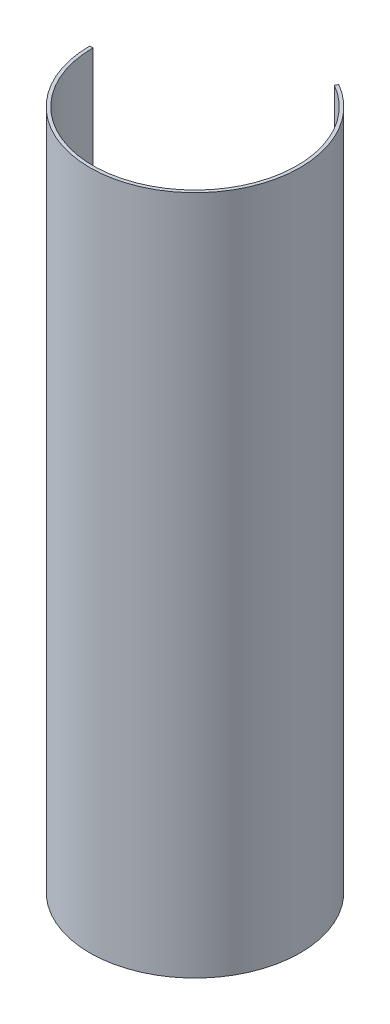
ISO-10303-21;
HEADER;
FILE_DESCRIPTION(('STEP AP214'),'2;1');
FILE_NAME('part.step','',(''),(''),'','','');
FILE_SCHEMA(('AUTOMOTIVE_DESIGN { 1 0 10303 214 1 1 1 1 }'));
ENDSEC;
DATA;
#1=APPLICATION_CONTEXT('core data for automotive mechanical design processes');
#2=APPLICATION_PROTOCOL_DEFINITION('international standard','automotive_design',2000,#1);
#3=PRODUCT_CONTEXT('',#1,'mechanical');
#4=PRODUCT('Part','Part','',(#3));
#5=PRODUCT_RELATED_PRODUCT_CATEGORY('part','',(#4));
#6=PRODUCT_DEFINITION_FORMATION('','',#4);
#7=PRODUCT_DEFINITION_CONTEXT('part definition',#1,'design');
#8=PRODUCT_DEFINITION('design','',#6,#7);
#9=PRODUCT_DEFINITION_SHAPE('','',#8);
#10=(LENGTH_UNIT() NAMED_UNIT(*) SI_UNIT(.MILLI.,.METRE.));
#11=(NAMED_UNIT(*) PLANE_ANGLE_UNIT() SI_UNIT($,.RADIAN.));
#12=(NAMED_UNIT(*) SI_UNIT($,.STERADIAN.) SOLID_ANGLE_UNIT());
#13=UNCERTAINTY_MEASURE_WITH_UNIT(LENGTH_MEASURE(1.E-05),#10,'distance_accuracy_value','');
#14=(GEOMETRIC_REPRESENTATION_CONTEXT(3) GLOBAL_UNCERTAINTY_ASSIGNED_CONTEXT((#13)) GLOBAL_UNIT_ASSIGNED_CONTEXT((#10,
#11,#12)) REPRESENTATION_CONTEXT('',''));
#15=CARTESIAN_POINT('',(0.,0.,0.));
#16=DIRECTION('',(0.,0.,1.));
#17=DIRECTION('',(1.,0.,0.));
#18=AXIS2_PLACEMENT_3D('',#15,#16,#17);
#19=CARTESIAN_POINT('',(0.,266.7,0.));
#20=DIRECTION('',(0.,1.,0.));
#21=DIRECTION('',(0.,0.,1.));
#22=AXIS2_PLACEMENT_3D('',#19,#20,#21);
#23=PLANE('',#22);
#24=CARTESIAN_POINT('',(0.,266.7,0.));
#25=DIRECTION('',(0.,1.,0.));
#26=DIRECTION('',(0.,0.,1.));
#27=AXIS2_PLACEMENT_3D('',#24,#25,#26);
#28=CIRCLE('',#27,41.275);
#29=CARTESIAN_POINT('',(-41.275,266.7,0.));
#30=VERTEX_POINT('',#29);
#31=CARTESIAN_POINT('',(20.6374999999999,266.7,-35.7451985412028));
#32=VERTEX_POINT('',#31);
#33=EDGE_CURVE('E92',#30,#32,#28,.T.);
#34=ORIENTED_EDGE('',*,*,#33,.T.);
#35=DIRECTION('',(0.499999999999998,0.,-0.86602540378444));
#36=VECTOR('',#35,1.);
#37=CARTESIAN_POINT('',(91.7274562269717,266.7,-158.876614634166));
#38=LINE('',#37,#36);
#39=CARTESIAN_POINT('',(20.0024999999999,266.7,-34.6453462783965));
#40=VERTEX_POINT('',#39);
#41=EDGE_CURVE('E74',#40,#32,#38,.T.);
#42=ORIENTED_EDGE('',*,*,#41,.F.);
#43=CARTESIAN_POINT('',(0.,266.7,0.));
#44=DIRECTION('',(0.,1.,0.));
#45=DIRECTION('',(0.,0.,1.));
#46=AXIS2_PLACEMENT_3D('',#43,#44,#45);
#47=CIRCLE('',#46,40.005);
#48=CARTESIAN_POINT('',(-40.005,266.7,0.));
#49=VERTEX_POINT('',#48);
#50=EDGE_CURVE('E93',#49,#40,#47,.T.);
#51=ORIENTED_EDGE('',*,*,#50,.F.);
#52=DIRECTION('',(1.,0.,0.));
#53=VECTOR('',#52,1.);
#54=CARTESIAN_POINT('',(0.,266.7,0.));
#55=LINE('',#54,#53);
#56=EDGE_CURVE('E55',#30,#49,#55,.T.);
#57=ORIENTED_EDGE('',*,*,#56,.F.);
#58=EDGE_LOOP('',(#34,#42,#51,#57));
#59=FACE_BOUND('',#58,.T.);
#60=ADVANCED_FACE('F33',(#59),#23,.T.);
#61=CARTESIAN_POINT('',(0.,0.,0.));
#62=DIRECTION('',(0.,1.,0.));
#63=DIRECTION('',(0.,0.,1.));
#64=AXIS2_PLACEMENT_3D('',#61,#62,#63);
#65=PLANE('',#64);
#66=DIRECTION('',(0.499999999999998,0.,-0.86602540378444));
#67=VECTOR('',#66,1.);
#68=CARTESIAN_POINT('',(91.7274562269717,0.,-158.876614634166));
#69=LINE('',#68,#67);
#70=CARTESIAN_POINT('',(20.0024999999999,0.,-34.6453462783965));
#71=VERTEX_POINT('',#70);
#72=CARTESIAN_POINT('',(20.6374999999999,0.,-35.7451985412028));
#73=VERTEX_POINT('',#72);
#74=EDGE_CURVE('E48',#71,#73,#69,.T.);
#75=ORIENTED_EDGE('',*,*,#74,.T.);
#76=CARTESIAN_POINT('',(0.,0.,0.));
#77=DIRECTION('',(0.,1.,0.));
#78=DIRECTION('',(0.,0.,1.));
#79=AXIS2_PLACEMENT_3D('',#76,#77,#78);
#80=CIRCLE('',#79,41.275);
#81=CARTESIAN_POINT('',(-41.275,0.,0.));
#82=VERTEX_POINT('',#81);
#83=EDGE_CURVE('E87',#82,#73,#80,.T.);
#84=ORIENTED_EDGE('',*,*,#83,.F.);
#85=DIRECTION('',(1.,0.,0.));
#86=VECTOR('',#85,1.);
#87=CARTESIAN_POINT('',(0.,0.,0.));
#88=LINE('',#87,#86);
#89=CARTESIAN_POINT('',(-40.005,0.,0.));
#90=VERTEX_POINT('',#89);
#91=EDGE_CURVE('E89',#82,#90,#88,.T.);
#92=ORIENTED_EDGE('',*,*,#91,.T.);
#93=CARTESIAN_POINT('',(0.,0.,0.));
#94=DIRECTION('',(0.,1.,0.));
#95=DIRECTION('',(0.,0.,1.));
#96=AXIS2_PLACEMENT_3D('',#93,#94,#95);
#97=CIRCLE('',#96,40.005);
#98=EDGE_CURVE('E79',#90,#71,#97,.T.);
#99=ORIENTED_EDGE('',*,*,#98,.T.);
#100=EDGE_LOOP('',(#75,#84,#92,#99));
#101=FACE_BOUND('',#100,.T.);
#102=ADVANCED_FACE('F85',(#101),#65,.F.);
#103=CARTESIAN_POINT('',(0.,266.7,0.));
#104=DIRECTION('',(0.,-1.,0.));
#105=DIRECTION('',(0.,0.,-1.));
#106=AXIS2_PLACEMENT_3D('',#103,#104,#105);
#107=CYLINDRICAL_SURFACE('',#106,41.275);
#108=DIRECTION('',(0.,-1.,0.));
#109=VECTOR('',#108,1.);
#110=CARTESIAN_POINT('',(20.6374999999999,266.7,-35.7451985412028));
#111=LINE('',#110,#109);
#112=EDGE_CURVE('E71',#32,#73,#111,.T.);
#113=ORIENTED_EDGE('',*,*,#112,.F.);
#114=ORIENTED_EDGE('',*,*,#33,.F.);
#115=DIRECTION('',(0.,-1.,0.));
#116=VECTOR('',#115,1.);
#117=CARTESIAN_POINT('',(-41.275,266.7,0.));
#118=LINE('',#117,#116);
#119=EDGE_CURVE('E80',#82,#30,#118,.F.);
#120=ORIENTED_EDGE('',*,*,#119,.F.);
#121=ORIENTED_EDGE('',*,*,#83,.T.);
#122=EDGE_LOOP('',(#113,#114,#120,#121));
#123=FACE_BOUND('',#122,.T.);
#124=ADVANCED_FACE('F35',(#123),#107,.T.);
#125=CARTESIAN_POINT('',(0.,266.7,0.));
#126=DIRECTION('',(0.,-1.,0.));
#127=DIRECTION('',(0.,0.,-1.));
#128=AXIS2_PLACEMENT_3D('',#125,#126,#127);
#129=CYLINDRICAL_SURFACE('',#128,40.005);
#130=ORIENTED_EDGE('',*,*,#50,.T.);
#131=DIRECTION('',(0.,-1.,0.));
#132=VECTOR('',#131,1.);
#133=CARTESIAN_POINT('',(20.0024999999999,266.7,-34.6453462783965));
#134=LINE('',#133,#132);
#135=EDGE_CURVE('E11',#40,#71,#134,.T.);
#136=ORIENTED_EDGE('',*,*,#135,.T.);
#137=ORIENTED_EDGE('',*,*,#98,.F.);
#138=DIRECTION('',(0.,-1.,0.));
#139=VECTOR('',#138,1.);
#140=CARTESIAN_POINT('',(-40.005,266.7,0.));
#141=LINE('',#140,#139);
#142=EDGE_CURVE('E41',#90,#49,#141,.F.);
#143=ORIENTED_EDGE('',*,*,#142,.T.);
#144=EDGE_LOOP('',(#130,#136,#137,#143));
#145=FACE_BOUND('',#144,.T.);
#146=ADVANCED_FACE('F101',(#145),#129,.F.);
#147=CARTESIAN_POINT('',(0.,266.7,0.));
#148=DIRECTION('',(0.,0.,-1.));
#149=DIRECTION('',(-1.,0.,0.));
#150=AXIS2_PLACEMENT_3D('',#147,#148,#149);
#151=PLANE('',#150);
#152=ORIENTED_EDGE('',*,*,#119,.T.);
#153=ORIENTED_EDGE('',*,*,#56,.T.);
#154=ORIENTED_EDGE('',*,*,#142,.F.);
#155=ORIENTED_EDGE('',*,*,#91,.F.);
#156=EDGE_LOOP('',(#152,#153,#154,#155));
#157=FACE_BOUND('',#156,.T.);
#158=ADVANCED_FACE('F107',(#157),#151,.T.);
#159=CARTESIAN_POINT('',(91.7274562269717,266.7,-158.876614634166));
#160=DIRECTION('',(-0.86602540378444,0.,-0.499999999999998));
#161=DIRECTION('',(-0.499999999999998,0.,0.86602540378444));
#162=AXIS2_PLACEMENT_3D('',#159,#160,#161);
#163=PLANE('',#162);
#164=ORIENTED_EDGE('',*,*,#112,.T.);
#165=ORIENTED_EDGE('',*,*,#74,.F.);
#166=ORIENTED_EDGE('',*,*,#135,.F.);
#167=ORIENTED_EDGE('',*,*,#41,.T.);
#168=EDGE_LOOP('',(#164,#165,#166,#167));
#169=FACE_BOUND('',#168,.T.);
#170=ADVANCED_FACE('F72',(#169),#163,.T.);
#171=CLOSED_SHELL('',(#60,#102,#124,#146,#158,#170));
#172=MANIFOLD_SOLID_BREP('B2',#171);
#173=ADVANCED_BREP_SHAPE_REPRESENTATION('',(#18,#172),#14);
#174=SHAPE_DEFINITION_REPRESENTATION(#9,#173);
ENDSEC;
END-ISO-10303-21;
